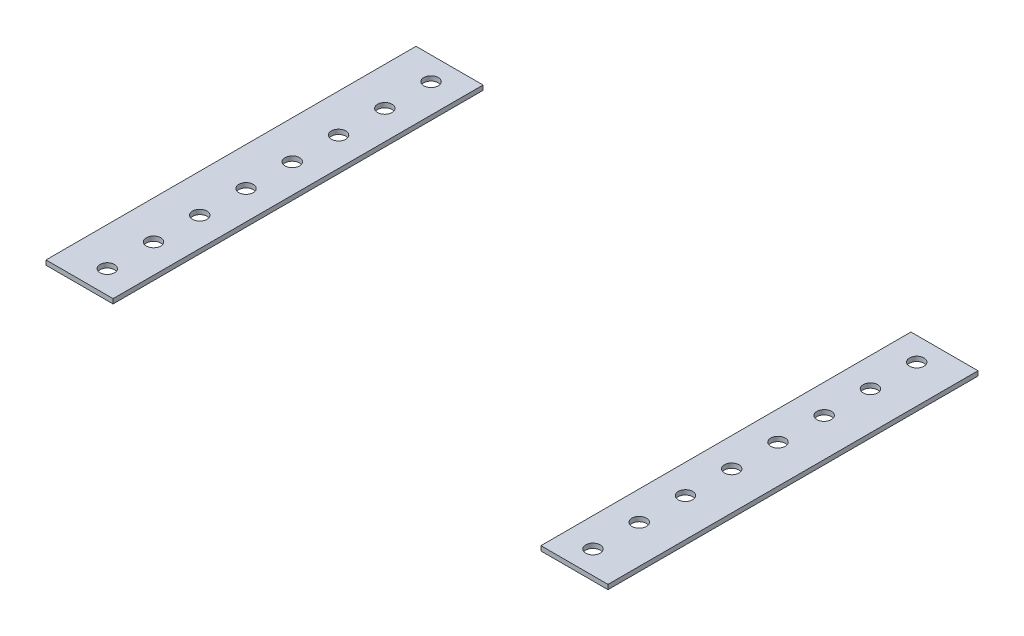
ISO-10303-21;
HEADER;
FILE_DESCRIPTION(('STEP AP214'),'2;1');
FILE_NAME('part.step','',(''),(''),'','','');
FILE_SCHEMA(('AUTOMOTIVE_DESIGN { 1 0 10303 214 1 1 1 1 }'));
ENDSEC;
DATA;
#1=APPLICATION_CONTEXT('core data for automotive mechanical design processes');
#2=APPLICATION_PROTOCOL_DEFINITION('international standard','automotive_design',2000,#1);
#3=PRODUCT_CONTEXT('',#1,'mechanical');
#4=PRODUCT('Part','Part','',(#3));
#5=PRODUCT_RELATED_PRODUCT_CATEGORY('part','',(#4));
#6=PRODUCT_DEFINITION_FORMATION('','',#4);
#7=PRODUCT_DEFINITION_CONTEXT('part definition',#1,'design');
#8=PRODUCT_DEFINITION('design','',#6,#7);
#9=PRODUCT_DEFINITION_SHAPE('','',#8);
#10=(LENGTH_UNIT() NAMED_UNIT(*) SI_UNIT(.MILLI.,.METRE.));
#11=(NAMED_UNIT(*) PLANE_ANGLE_UNIT() SI_UNIT($,.RADIAN.));
#12=(NAMED_UNIT(*) SI_UNIT($,.STERADIAN.) SOLID_ANGLE_UNIT());
#13=UNCERTAINTY_MEASURE_WITH_UNIT(LENGTH_MEASURE(1.E-05),#10,'distance_accuracy_value','');
#14=(GEOMETRIC_REPRESENTATION_CONTEXT(3) GLOBAL_UNCERTAINTY_ASSIGNED_CONTEXT((#13)) GLOBAL_UNIT_ASSIGNED_CONTEXT((#10,
#11,#12)) REPRESENTATION_CONTEXT('',''));
#15=CARTESIAN_POINT('',(0.,0.,0.));
#16=DIRECTION('',(0.,0.,1.));
#17=DIRECTION('',(1.,0.,0.));
#18=AXIS2_PLACEMENT_3D('',#15,#16,#17);
#19=CARTESIAN_POINT('',(170.474891640867,-2.54,-175.499845201238));
#20=DIRECTION('',(1.,0.,0.));
#21=DIRECTION('',(0.,0.,-1.));
#22=AXIS2_PLACEMENT_3D('',#19,#20,#21);
#23=PLANE('',#22);
#24=DIRECTION('',(0.,0.,-1.));
#25=VECTOR('',#24,1.);
#26=CARTESIAN_POINT('',(170.474891640867,0.,-175.499845201238));
#27=LINE('',#26,#25);
#28=CARTESIAN_POINT('',(170.474891640867,0.,27.7001547987616));
#29=VERTEX_POINT('',#28);
#30=CARTESIAN_POINT('',(170.474891640867,0.,-175.499845201238));
#31=VERTEX_POINT('',#30);
#32=EDGE_CURVE('E108',#29,#31,#27,.T.);
#33=ORIENTED_EDGE('',*,*,#32,.F.);
#34=DIRECTION('',(0.,1.,0.));
#35=VECTOR('',#34,1.);
#36=CARTESIAN_POINT('',(170.474891640867,-2.54,27.7001547987616));
#37=LINE('',#36,#35);
#38=CARTESIAN_POINT('',(170.474891640867,-2.54,27.7001547987616));
#39=VERTEX_POINT('',#38);
#40=EDGE_CURVE('E12',#39,#29,#37,.T.);
#41=ORIENTED_EDGE('',*,*,#40,.F.);
#42=DIRECTION('',(0.,0.,-1.));
#43=VECTOR('',#42,1.);
#44=CARTESIAN_POINT('',(170.474891640867,-2.54,-175.499845201238));
#45=LINE('',#44,#43);
#46=CARTESIAN_POINT('',(170.474891640867,-2.54,-175.499845201238));
#47=VERTEX_POINT('',#46);
#48=EDGE_CURVE('E101',#39,#47,#45,.T.);
#49=ORIENTED_EDGE('',*,*,#48,.T.);
#50=DIRECTION('',(0.,1.,0.));
#51=VECTOR('',#50,1.);
#52=CARTESIAN_POINT('',(170.474891640867,-2.54,-175.499845201238));
#53=LINE('',#52,#51);
#54=EDGE_CURVE('E46',#47,#31,#53,.T.);
#55=ORIENTED_EDGE('',*,*,#54,.T.);
#56=EDGE_LOOP('',(#33,#41,#49,#55));
#57=FACE_BOUND('',#56,.T.);
#58=ADVANCED_FACE('F43',(#57),#23,.T.);
#59=CARTESIAN_POINT('',(170.474891640867,-2.54,27.7001547987616));
#60=DIRECTION('',(0.,0.,1.));
#61=DIRECTION('',(1.,0.,0.));
#62=AXIS2_PLACEMENT_3D('',#59,#60,#61);
#63=PLANE('',#62);
#64=DIRECTION('',(1.,0.,0.));
#65=VECTOR('',#64,1.);
#66=CARTESIAN_POINT('',(170.474891640867,0.,27.7001547987616));
#67=LINE('',#66,#65);
#68=CARTESIAN_POINT('',(133.644891640867,0.,27.7001547987616));
#69=VERTEX_POINT('',#68);
#70=EDGE_CURVE('E103',#69,#29,#67,.T.);
#71=ORIENTED_EDGE('',*,*,#70,.F.);
#72=DIRECTION('',(0.,1.,0.));
#73=VECTOR('',#72,1.);
#74=CARTESIAN_POINT('',(133.644891640867,-2.54,27.7001547987616));
#75=LINE('',#74,#73);
#76=CARTESIAN_POINT('',(133.644891640867,-2.54,27.7001547987616));
#77=VERTEX_POINT('',#76);
#78=EDGE_CURVE('E52',#77,#69,#75,.T.);
#79=ORIENTED_EDGE('',*,*,#78,.F.);
#80=DIRECTION('',(1.,0.,0.));
#81=VECTOR('',#80,1.);
#82=CARTESIAN_POINT('',(170.474891640867,-2.54,27.7001547987616));
#83=LINE('',#82,#81);
#84=EDGE_CURVE('E98',#77,#39,#83,.T.);
#85=ORIENTED_EDGE('',*,*,#84,.T.);
#86=ORIENTED_EDGE('',*,*,#40,.T.);
#87=EDGE_LOOP('',(#71,#79,#85,#86));
#88=FACE_BOUND('',#87,.T.);
#89=ADVANCED_FACE('F119',(#88),#63,.T.);
#90=CARTESIAN_POINT('',(133.644891640867,-2.54,-175.499845201238));
#91=DIRECTION('',(-1.,0.,0.));
#92=DIRECTION('',(0.,0.,1.));
#93=AXIS2_PLACEMENT_3D('',#90,#91,#92);
#94=PLANE('',#93);
#95=DIRECTION('',(0.,0.,1.));
#96=VECTOR('',#95,1.);
#97=CARTESIAN_POINT('',(133.644891640867,0.,-175.499845201238));
#98=LINE('',#97,#96);
#99=CARTESIAN_POINT('',(133.644891640867,0.,-175.499845201238));
#100=VERTEX_POINT('',#99);
#101=EDGE_CURVE('E93',#100,#69,#98,.T.);
#102=ORIENTED_EDGE('',*,*,#101,.F.);
#103=DIRECTION('',(0.,1.,0.));
#104=VECTOR('',#103,1.);
#105=CARTESIAN_POINT('',(133.644891640867,-2.54,-175.499845201238));
#106=LINE('',#105,#104);
#107=CARTESIAN_POINT('',(133.644891640867,-2.54,-175.499845201238));
#108=VERTEX_POINT('',#107);
#109=EDGE_CURVE('E88',#108,#100,#106,.T.);
#110=ORIENTED_EDGE('',*,*,#109,.F.);
#111=DIRECTION('',(0.,0.,1.));
#112=VECTOR('',#111,1.);
#113=CARTESIAN_POINT('',(133.644891640867,-2.54,-175.499845201238));
#114=LINE('',#113,#112);
#115=EDGE_CURVE('E91',#108,#77,#114,.T.);
#116=ORIENTED_EDGE('',*,*,#115,.T.);
#117=ORIENTED_EDGE('',*,*,#78,.T.);
#118=EDGE_LOOP('',(#102,#110,#116,#117));
#119=FACE_BOUND('',#118,.T.);
#120=ADVANCED_FACE('F90',(#119),#94,.T.);
#121=CARTESIAN_POINT('',(170.474891640867,-2.54,-175.499845201238));
#122=DIRECTION('',(0.,0.,-1.));
#123=DIRECTION('',(-1.,0.,0.));
#124=AXIS2_PLACEMENT_3D('',#121,#122,#123);
#125=PLANE('',#124);
#126=DIRECTION('',(-1.,0.,0.));
#127=VECTOR('',#126,1.);
#128=CARTESIAN_POINT('',(170.474891640867,0.,-175.499845201238));
#129=LINE('',#128,#127);
#130=EDGE_CURVE('E111',#31,#100,#129,.T.);
#131=ORIENTED_EDGE('',*,*,#130,.F.);
#132=ORIENTED_EDGE('',*,*,#54,.F.);
#133=DIRECTION('',(-1.,0.,0.));
#134=VECTOR('',#133,1.);
#135=CARTESIAN_POINT('',(170.474891640867,-2.54,-175.499845201238));
#136=LINE('',#135,#134);
#137=EDGE_CURVE('E97',#47,#108,#136,.T.);
#138=ORIENTED_EDGE('',*,*,#137,.T.);
#139=ORIENTED_EDGE('',*,*,#109,.T.);
#140=EDGE_LOOP('',(#131,#132,#138,#139));
#141=FACE_BOUND('',#140,.T.);
#142=ADVANCED_FACE('F100',(#141),#125,.T.);
#143=CARTESIAN_POINT('',(0.,-2.54,0.));
#144=DIRECTION('',(0.,-1.,0.));
#145=DIRECTION('',(0.,0.,-1.));
#146=AXIS2_PLACEMENT_3D('',#143,#144,#145);
#147=PLANE('',#146);
#148=CARTESIAN_POINT('',(149.519891640867,-2.54,15.0001547987616));
#149=DIRECTION('',(0.,-1.,0.));
#150=DIRECTION('',(0.,0.,-1.));
#151=AXIS2_PLACEMENT_3D('',#148,#149,#150);
#152=CIRCLE('',#151,3.96874999999999);
#153=CARTESIAN_POINT('',(149.519891640867,-2.54,11.0314047987616));
#154=VERTEX_POINT('',#153);
#155=EDGE_CURVE('E176',#154,#154,#152,.F.);
#156=ORIENTED_EDGE('',*,*,#155,.T.);
#157=EDGE_LOOP('',(#156));
#158=FACE_BOUND('',#157,.T.);
#159=CARTESIAN_POINT('',(149.519891640867,-2.54,-10.3998452012384));
#160=DIRECTION('',(0.,-1.,0.));
#161=DIRECTION('',(0.,0.,-1.));
#162=AXIS2_PLACEMENT_3D('',#159,#160,#161);
#163=CIRCLE('',#162,3.96874999999999);
#164=CARTESIAN_POINT('',(149.519891640867,-2.54,-14.3685952012384));
#165=VERTEX_POINT('',#164);
#166=EDGE_CURVE('E185',#165,#165,#163,.F.);
#167=ORIENTED_EDGE('',*,*,#166,.T.);
#168=EDGE_LOOP('',(#167));
#169=FACE_BOUND('',#168,.T.);
#170=CARTESIAN_POINT('',(149.519891640867,-2.54,-35.7998452012384));
#171=DIRECTION('',(0.,-1.,0.));
#172=DIRECTION('',(0.,0.,-1.));
#173=AXIS2_PLACEMENT_3D('',#170,#171,#172);
#174=CIRCLE('',#173,3.96875000000002);
#175=CARTESIAN_POINT('',(149.519891640867,-2.54,-39.7685952012384));
#176=VERTEX_POINT('',#175);
#177=EDGE_CURVE('E191',#176,#176,#174,.F.);
#178=ORIENTED_EDGE('',*,*,#177,.T.);
#179=EDGE_LOOP('',(#178));
#180=FACE_BOUND('',#179,.T.);
#181=CARTESIAN_POINT('',(149.519891640867,-2.54,-61.1998452012384));
#182=DIRECTION('',(0.,-1.,0.));
#183=DIRECTION('',(0.,0.,-1.));
#184=AXIS2_PLACEMENT_3D('',#181,#182,#183);
#185=CIRCLE('',#184,3.96875000000002);
#186=CARTESIAN_POINT('',(149.519891640867,-2.54,-65.1685952012384));
#187=VERTEX_POINT('',#186);
#188=EDGE_CURVE('E197',#187,#187,#185,.F.);
#189=ORIENTED_EDGE('',*,*,#188,.T.);
#190=EDGE_LOOP('',(#189));
#191=FACE_BOUND('',#190,.T.);
#192=CARTESIAN_POINT('',(149.519891640867,-2.54,-86.5998452012384));
#193=DIRECTION('',(0.,-1.,0.));
#194=DIRECTION('',(0.,0.,-1.));
#195=AXIS2_PLACEMENT_3D('',#192,#193,#194);
#196=CIRCLE('',#195,3.96875000000002);
#197=CARTESIAN_POINT('',(149.519891640867,-2.54,-90.5685952012384));
#198=VERTEX_POINT('',#197);
#199=EDGE_CURVE('E203',#198,#198,#196,.F.);
#200=ORIENTED_EDGE('',*,*,#199,.T.);
#201=EDGE_LOOP('',(#200));
#202=FACE_BOUND('',#201,.T.);
#203=CARTESIAN_POINT('',(149.519891640867,-2.54,-111.999845201238));
#204=DIRECTION('',(0.,-1.,0.));
#205=DIRECTION('',(0.,0.,-1.));
#206=AXIS2_PLACEMENT_3D('',#203,#204,#205);
#207=CIRCLE('',#206,3.96874999999999);
#208=CARTESIAN_POINT('',(149.519891640867,-2.54,-115.968595201238));
#209=VERTEX_POINT('',#208);
#210=EDGE_CURVE('E209',#209,#209,#207,.F.);
#211=ORIENTED_EDGE('',*,*,#210,.T.);
#212=EDGE_LOOP('',(#211));
#213=FACE_BOUND('',#212,.T.);
#214=CARTESIAN_POINT('',(149.519891640867,-2.54,-137.399845201238));
#215=DIRECTION('',(0.,-1.,0.));
#216=DIRECTION('',(0.,0.,-1.));
#217=AXIS2_PLACEMENT_3D('',#214,#215,#216);
#218=CIRCLE('',#217,3.96874999999999);
#219=CARTESIAN_POINT('',(149.519891640867,-2.54,-141.368595201238));
#220=VERTEX_POINT('',#219);
#221=EDGE_CURVE('E215',#220,#220,#218,.F.);
#222=ORIENTED_EDGE('',*,*,#221,.T.);
#223=EDGE_LOOP('',(#222));
#224=FACE_BOUND('',#223,.T.);
#225=CARTESIAN_POINT('',(149.519891640867,-2.54,-162.799845201238));
#226=DIRECTION('',(0.,-1.,0.));
#227=DIRECTION('',(0.,0.,-1.));
#228=AXIS2_PLACEMENT_3D('',#225,#226,#227);
#229=CIRCLE('',#228,3.96874999999999);
#230=CARTESIAN_POINT('',(149.519891640867,-2.54,-166.768595201238));
#231=VERTEX_POINT('',#230);
#232=EDGE_CURVE('E220',#231,#231,#229,.F.);
#233=ORIENTED_EDGE('',*,*,#232,.T.);
#234=EDGE_LOOP('',(#233));
#235=FACE_BOUND('',#234,.T.);
#236=ORIENTED_EDGE('',*,*,#48,.F.);
#237=ORIENTED_EDGE('',*,*,#84,.F.);
#238=ORIENTED_EDGE('',*,*,#115,.F.);
#239=ORIENTED_EDGE('',*,*,#137,.F.);
#240=EDGE_LOOP('',(#236,#237,#238,#239));
#241=FACE_BOUND('',#240,.T.);
#242=ADVANCED_FACE('F96',(#158,#169,#180,#191,#202,#213,#224,#235,#241),#147,.T.);
#243=CARTESIAN_POINT('',(0.,0.,0.));
#244=DIRECTION('',(0.,-1.,0.));
#245=DIRECTION('',(0.,0.,-1.));
#246=AXIS2_PLACEMENT_3D('',#243,#244,#245);
#247=PLANE('',#246);
#248=CARTESIAN_POINT('',(149.519891640867,0.,15.0001547987616));
#249=DIRECTION('',(0.,1.,0.));
#250=DIRECTION('',(0.,0.,-1.));
#251=AXIS2_PLACEMENT_3D('',#248,#249,#250);
#252=CIRCLE('',#251,3.96874999999999);
#253=CARTESIAN_POINT('',(149.519891640867,0.,11.0314047987616));
#254=VERTEX_POINT('',#253);
#255=EDGE_CURVE('E112',#254,#254,#252,.T.);
#256=ORIENTED_EDGE('',*,*,#255,.F.);
#257=EDGE_LOOP('',(#256));
#258=FACE_BOUND('',#257,.T.);
#259=CARTESIAN_POINT('',(149.519891640867,0.,-10.3998452012384));
#260=DIRECTION('',(0.,1.,0.));
#261=DIRECTION('',(0.,0.,-1.));
#262=AXIS2_PLACEMENT_3D('',#259,#260,#261);
#263=CIRCLE('',#262,3.96874999999999);
#264=CARTESIAN_POINT('',(149.519891640867,0.,-14.3685952012384));
#265=VERTEX_POINT('',#264);
#266=EDGE_CURVE('E180',#265,#265,#263,.T.);
#267=ORIENTED_EDGE('',*,*,#266,.F.);
#268=EDGE_LOOP('',(#267));
#269=FACE_BOUND('',#268,.T.);
#270=CARTESIAN_POINT('',(149.519891640867,0.,-35.7998452012384));
#271=DIRECTION('',(0.,1.,0.));
#272=DIRECTION('',(0.,0.,-1.));
#273=AXIS2_PLACEMENT_3D('',#270,#271,#272);
#274=CIRCLE('',#273,3.96875000000002);
#275=CARTESIAN_POINT('',(149.519891640867,0.,-39.7685952012384));
#276=VERTEX_POINT('',#275);
#277=EDGE_CURVE('E188',#276,#276,#274,.T.);
#278=ORIENTED_EDGE('',*,*,#277,.F.);
#279=EDGE_LOOP('',(#278));
#280=FACE_BOUND('',#279,.T.);
#281=CARTESIAN_POINT('',(149.519891640867,0.,-61.1998452012384));
#282=DIRECTION('',(0.,1.,0.));
#283=DIRECTION('',(0.,0.,-1.));
#284=AXIS2_PLACEMENT_3D('',#281,#282,#283);
#285=CIRCLE('',#284,3.96875000000002);
#286=CARTESIAN_POINT('',(149.519891640867,0.,-65.1685952012384));
#287=VERTEX_POINT('',#286);
#288=EDGE_CURVE('E194',#287,#287,#285,.T.);
#289=ORIENTED_EDGE('',*,*,#288,.F.);
#290=EDGE_LOOP('',(#289));
#291=FACE_BOUND('',#290,.T.);
#292=CARTESIAN_POINT('',(149.519891640867,0.,-86.5998452012384));
#293=DIRECTION('',(0.,1.,0.));
#294=DIRECTION('',(0.,0.,-1.));
#295=AXIS2_PLACEMENT_3D('',#292,#293,#294);
#296=CIRCLE('',#295,3.96875000000002);
#297=CARTESIAN_POINT('',(149.519891640867,0.,-90.5685952012384));
#298=VERTEX_POINT('',#297);
#299=EDGE_CURVE('E200',#298,#298,#296,.T.);
#300=ORIENTED_EDGE('',*,*,#299,.F.);
#301=EDGE_LOOP('',(#300));
#302=FACE_BOUND('',#301,.T.);
#303=CARTESIAN_POINT('',(149.519891640867,0.,-111.999845201238));
#304=DIRECTION('',(0.,1.,0.));
#305=DIRECTION('',(0.,0.,-1.));
#306=AXIS2_PLACEMENT_3D('',#303,#304,#305);
#307=CIRCLE('',#306,3.96874999999999);
#308=CARTESIAN_POINT('',(149.519891640867,0.,-115.968595201238));
#309=VERTEX_POINT('',#308);
#310=EDGE_CURVE('E206',#309,#309,#307,.T.);
#311=ORIENTED_EDGE('',*,*,#310,.F.);
#312=EDGE_LOOP('',(#311));
#313=FACE_BOUND('',#312,.T.);
#314=CARTESIAN_POINT('',(149.519891640867,0.,-137.399845201238));
#315=DIRECTION('',(0.,1.,0.));
#316=DIRECTION('',(0.,0.,-1.));
#317=AXIS2_PLACEMENT_3D('',#314,#315,#316);
#318=CIRCLE('',#317,3.96874999999999);
#319=CARTESIAN_POINT('',(149.519891640867,0.,-141.368595201238));
#320=VERTEX_POINT('',#319);
#321=EDGE_CURVE('E212',#320,#320,#318,.T.);
#322=ORIENTED_EDGE('',*,*,#321,.F.);
#323=EDGE_LOOP('',(#322));
#324=FACE_BOUND('',#323,.T.);
#325=CARTESIAN_POINT('',(149.519891640867,0.,-162.799845201238));
#326=DIRECTION('',(0.,1.,0.));
#327=DIRECTION('',(0.,0.,-1.));
#328=AXIS2_PLACEMENT_3D('',#325,#326,#327);
#329=CIRCLE('',#328,3.96874999999999);
#330=CARTESIAN_POINT('',(149.519891640867,0.,-166.768595201238));
#331=VERTEX_POINT('',#330);
#332=EDGE_CURVE('E218',#331,#331,#329,.T.);
#333=ORIENTED_EDGE('',*,*,#332,.F.);
#334=EDGE_LOOP('',(#333));
#335=FACE_BOUND('',#334,.T.);
#336=ORIENTED_EDGE('',*,*,#32,.T.);
#337=ORIENTED_EDGE('',*,*,#130,.T.);
#338=ORIENTED_EDGE('',*,*,#101,.T.);
#339=ORIENTED_EDGE('',*,*,#70,.T.);
#340=EDGE_LOOP('',(#336,#337,#338,#339));
#341=FACE_BOUND('',#340,.T.);
#342=ADVANCED_FACE('F118',(#258,#269,#280,#291,#302,#313,#324,#335,#341),#247,.F.);
#343=CARTESIAN_POINT('',(149.519891640867,-2.541,-162.799845201238));
#344=DIRECTION('',(0.,1.,0.));
#345=DIRECTION('',(0.,0.,1.));
#346=AXIS2_PLACEMENT_3D('',#343,#344,#345);
#347=CYLINDRICAL_SURFACE('',#346,3.96874999999999);
#348=ORIENTED_EDGE('',*,*,#232,.F.);
#349=EDGE_LOOP('',(#348));
#350=FACE_BOUND('',#349,.T.);
#351=ORIENTED_EDGE('',*,*,#332,.T.);
#352=EDGE_LOOP('',(#351));
#353=FACE_BOUND('',#352,.T.);
#354=ADVANCED_FACE('F137',(#350,#353),#347,.F.);
#355=CARTESIAN_POINT('',(149.519891640867,-2.541,-137.399845201238));
#356=DIRECTION('',(0.,1.,0.));
#357=DIRECTION('',(0.,0.,1.));
#358=AXIS2_PLACEMENT_3D('',#355,#356,#357);
#359=CYLINDRICAL_SURFACE('',#358,3.96874999999999);
#360=ORIENTED_EDGE('',*,*,#221,.F.);
#361=EDGE_LOOP('',(#360));
#362=FACE_BOUND('',#361,.T.);
#363=ORIENTED_EDGE('',*,*,#321,.T.);
#364=EDGE_LOOP('',(#363));
#365=FACE_BOUND('',#364,.T.);
#366=ADVANCED_FACE('F144',(#362,#365),#359,.F.);
#367=CARTESIAN_POINT('',(149.519891640867,-2.541,-111.999845201238));
#368=DIRECTION('',(0.,1.,0.));
#369=DIRECTION('',(0.,0.,1.));
#370=AXIS2_PLACEMENT_3D('',#367,#368,#369);
#371=CYLINDRICAL_SURFACE('',#370,3.96874999999999);
#372=ORIENTED_EDGE('',*,*,#210,.F.);
#373=EDGE_LOOP('',(#372));
#374=FACE_BOUND('',#373,.T.);
#375=ORIENTED_EDGE('',*,*,#310,.T.);
#376=EDGE_LOOP('',(#375));
#377=FACE_BOUND('',#376,.T.);
#378=ADVANCED_FACE('F148',(#374,#377),#371,.F.);
#379=CARTESIAN_POINT('',(149.519891640867,-2.541,-86.5998452012384));
#380=DIRECTION('',(0.,1.,0.));
#381=DIRECTION('',(0.,0.,1.));
#382=AXIS2_PLACEMENT_3D('',#379,#380,#381);
#383=CYLINDRICAL_SURFACE('',#382,3.96875000000002);
#384=ORIENTED_EDGE('',*,*,#199,.F.);
#385=EDGE_LOOP('',(#384));
#386=FACE_BOUND('',#385,.T.);
#387=ORIENTED_EDGE('',*,*,#299,.T.);
#388=EDGE_LOOP('',(#387));
#389=FACE_BOUND('',#388,.T.);
#390=ADVANCED_FACE('F152',(#386,#389),#383,.F.);
#391=CARTESIAN_POINT('',(149.519891640867,-2.541,-61.1998452012384));
#392=DIRECTION('',(0.,1.,0.));
#393=DIRECTION('',(0.,0.,1.));
#394=AXIS2_PLACEMENT_3D('',#391,#392,#393);
#395=CYLINDRICAL_SURFACE('',#394,3.96875000000002);
#396=ORIENTED_EDGE('',*,*,#188,.F.);
#397=EDGE_LOOP('',(#396));
#398=FACE_BOUND('',#397,.T.);
#399=ORIENTED_EDGE('',*,*,#288,.T.);
#400=EDGE_LOOP('',(#399));
#401=FACE_BOUND('',#400,.T.);
#402=ADVANCED_FACE('F156',(#398,#401),#395,.F.);
#403=CARTESIAN_POINT('',(149.519891640867,-2.541,-35.7998452012384));
#404=DIRECTION('',(0.,1.,0.));
#405=DIRECTION('',(0.,0.,1.));
#406=AXIS2_PLACEMENT_3D('',#403,#404,#405);
#407=CYLINDRICAL_SURFACE('',#406,3.96875000000002);
#408=ORIENTED_EDGE('',*,*,#177,.F.);
#409=EDGE_LOOP('',(#408));
#410=FACE_BOUND('',#409,.T.);
#411=ORIENTED_EDGE('',*,*,#277,.T.);
#412=EDGE_LOOP('',(#411));
#413=FACE_BOUND('',#412,.T.);
#414=ADVANCED_FACE('F160',(#410,#413),#407,.F.);
#415=CARTESIAN_POINT('',(149.519891640867,-2.541,-10.3998452012384));
#416=DIRECTION('',(0.,1.,0.));
#417=DIRECTION('',(0.,0.,1.));
#418=AXIS2_PLACEMENT_3D('',#415,#416,#417);
#419=CYLINDRICAL_SURFACE('',#418,3.96874999999999);
#420=ORIENTED_EDGE('',*,*,#166,.F.);
#421=EDGE_LOOP('',(#420));
#422=FACE_BOUND('',#421,.T.);
#423=ORIENTED_EDGE('',*,*,#266,.T.);
#424=EDGE_LOOP('',(#423));
#425=FACE_BOUND('',#424,.T.);
#426=ADVANCED_FACE('F164',(#422,#425),#419,.F.);
#427=CARTESIAN_POINT('',(149.519891640867,-2.541,15.0001547987616));
#428=DIRECTION('',(0.,1.,0.));
#429=DIRECTION('',(0.,0.,1.));
#430=AXIS2_PLACEMENT_3D('',#427,#428,#429);
#431=CYLINDRICAL_SURFACE('',#430,3.96874999999999);
#432=ORIENTED_EDGE('',*,*,#155,.F.);
#433=EDGE_LOOP('',(#432));
#434=FACE_BOUND('',#433,.T.);
#435=ORIENTED_EDGE('',*,*,#255,.T.);
#436=EDGE_LOOP('',(#435));
#437=FACE_BOUND('',#436,.T.);
#438=ADVANCED_FACE('F168',(#434,#437),#431,.F.);
#439=CLOSED_SHELL('',(#58,#89,#120,#142,#242,#342,#354,#366,#378,#390,#402,#414,#426,#438));
#440=MANIFOLD_SOLID_BREP('B2',#439);
#441=CARTESIAN_POINT('',(-138.135108359133,-2.54,-175.499845201238));
#442=DIRECTION('',(-1.,0.,0.));
#443=DIRECTION('',(0.,0.,1.));
#444=AXIS2_PLACEMENT_3D('',#441,#442,#443);
#445=PLANE('',#444);
#446=DIRECTION('',(0.,0.,1.));
#447=VECTOR('',#446,1.);
#448=CARTESIAN_POINT('',(-138.135108359133,0.,-175.499845201238));
#449=LINE('',#448,#447);
#450=CARTESIAN_POINT('',(-138.135108359133,0.,-175.499845201238));
#451=VERTEX_POINT('',#450);
#452=CARTESIAN_POINT('',(-138.135108359133,0.,27.7001547987616));
#453=VERTEX_POINT('',#452);
#454=EDGE_CURVE('E400',#451,#453,#449,.T.);
#455=ORIENTED_EDGE('',*,*,#454,.F.);
#456=DIRECTION('',(0.,1.,0.));
#457=VECTOR('',#456,1.);
#458=CARTESIAN_POINT('',(-138.135108359133,-2.54,-175.499845201238));
#459=LINE('',#458,#457);
#460=CARTESIAN_POINT('',(-138.135108359133,-2.54,-175.499845201238));
#461=VERTEX_POINT('',#460);
#462=EDGE_CURVE('E41',#461,#451,#459,.T.);
#463=ORIENTED_EDGE('',*,*,#462,.F.);
#464=DIRECTION('',(0.,0.,1.));
#465=VECTOR('',#464,1.);
#466=CARTESIAN_POINT('',(-138.135108359133,-2.54,-175.499845201238));
#467=LINE('',#466,#465);
#468=CARTESIAN_POINT('',(-138.135108359133,-2.54,27.7001547987616));
#469=VERTEX_POINT('',#468);
#470=EDGE_CURVE('E393',#461,#469,#467,.T.);
#471=ORIENTED_EDGE('',*,*,#470,.T.);
#472=DIRECTION('',(0.,1.,0.));
#473=VECTOR('',#472,1.);
#474=CARTESIAN_POINT('',(-138.135108359133,-2.54,27.7001547987616));
#475=LINE('',#474,#473);
#476=EDGE_CURVE('E338',#469,#453,#475,.T.);
#477=ORIENTED_EDGE('',*,*,#476,.T.);
#478=EDGE_LOOP('',(#455,#463,#471,#477));
#479=FACE_BOUND('',#478,.T.);
#480=ADVANCED_FACE('F335',(#479),#445,.T.);
#481=CARTESIAN_POINT('',(-138.135108359133,-2.54,-175.499845201238));
#482=DIRECTION('',(0.,0.,-1.));
#483=DIRECTION('',(-1.,0.,0.));
#484=AXIS2_PLACEMENT_3D('',#481,#482,#483);
#485=PLANE('',#484);
#486=DIRECTION('',(-1.,0.,0.));
#487=VECTOR('',#486,1.);
#488=CARTESIAN_POINT('',(-138.135108359133,0.,-175.499845201238));
#489=LINE('',#488,#487);
#490=CARTESIAN_POINT('',(-101.305108359133,0.,-175.499845201238));
#491=VERTEX_POINT('',#490);
#492=EDGE_CURVE('E395',#491,#451,#489,.T.);
#493=ORIENTED_EDGE('',*,*,#492,.F.);
#494=DIRECTION('',(0.,1.,0.));
#495=VECTOR('',#494,1.);
#496=CARTESIAN_POINT('',(-101.305108359133,-2.54,-175.499845201238));
#497=LINE('',#496,#495);
#498=CARTESIAN_POINT('',(-101.305108359133,-2.54,-175.499845201238));
#499=VERTEX_POINT('',#498);
#500=EDGE_CURVE('E344',#499,#491,#497,.T.);
#501=ORIENTED_EDGE('',*,*,#500,.F.);
#502=DIRECTION('',(-1.,0.,0.));
#503=VECTOR('',#502,1.);
#504=CARTESIAN_POINT('',(-138.135108359133,-2.54,-175.499845201238));
#505=LINE('',#504,#503);
#506=EDGE_CURVE('E390',#499,#461,#505,.T.);
#507=ORIENTED_EDGE('',*,*,#506,.T.);
#508=ORIENTED_EDGE('',*,*,#462,.T.);
#509=EDGE_LOOP('',(#493,#501,#507,#508));
#510=FACE_BOUND('',#509,.T.);
#511=ADVANCED_FACE('F411',(#510),#485,.T.);
#512=CARTESIAN_POINT('',(-101.305108359133,-2.54,-175.499845201238));
#513=DIRECTION('',(1.,0.,0.));
#514=DIRECTION('',(0.,0.,-1.));
#515=AXIS2_PLACEMENT_3D('',#512,#513,#514);
#516=PLANE('',#515);
#517=DIRECTION('',(0.,0.,-1.));
#518=VECTOR('',#517,1.);
#519=CARTESIAN_POINT('',(-101.305108359133,0.,-175.499845201238));
#520=LINE('',#519,#518);
#521=CARTESIAN_POINT('',(-101.305108359133,0.,27.7001547987616));
#522=VERTEX_POINT('',#521);
#523=EDGE_CURVE('E385',#522,#491,#520,.T.);
#524=ORIENTED_EDGE('',*,*,#523,.F.);
#525=DIRECTION('',(0.,1.,0.));
#526=VECTOR('',#525,1.);
#527=CARTESIAN_POINT('',(-101.305108359133,-2.54,27.7001547987616));
#528=LINE('',#527,#526);
#529=CARTESIAN_POINT('',(-101.305108359133,-2.54,27.7001547987616));
#530=VERTEX_POINT('',#529);
#531=EDGE_CURVE('E380',#530,#522,#528,.T.);
#532=ORIENTED_EDGE('',*,*,#531,.F.);
#533=DIRECTION('',(0.,0.,-1.));
#534=VECTOR('',#533,1.);
#535=CARTESIAN_POINT('',(-101.305108359133,-2.54,-175.499845201238));
#536=LINE('',#535,#534);
#537=EDGE_CURVE('E383',#530,#499,#536,.T.);
#538=ORIENTED_EDGE('',*,*,#537,.T.);
#539=ORIENTED_EDGE('',*,*,#500,.T.);
#540=EDGE_LOOP('',(#524,#532,#538,#539));
#541=FACE_BOUND('',#540,.T.);
#542=ADVANCED_FACE('F382',(#541),#516,.T.);
#543=CARTESIAN_POINT('',(-138.135108359133,-2.54,27.7001547987616));
#544=DIRECTION('',(0.,0.,1.));
#545=DIRECTION('',(1.,0.,0.));
#546=AXIS2_PLACEMENT_3D('',#543,#544,#545);
#547=PLANE('',#546);
#548=DIRECTION('',(1.,0.,0.));
#549=VECTOR('',#548,1.);
#550=CARTESIAN_POINT('',(-138.135108359133,0.,27.7001547987616));
#551=LINE('',#550,#549);
#552=EDGE_CURVE('E403',#453,#522,#551,.T.);
#553=ORIENTED_EDGE('',*,*,#552,.F.);
#554=ORIENTED_EDGE('',*,*,#476,.F.);
#555=DIRECTION('',(1.,0.,0.));
#556=VECTOR('',#555,1.);
#557=CARTESIAN_POINT('',(-138.135108359133,-2.54,27.7001547987616));
#558=LINE('',#557,#556);
#559=EDGE_CURVE('E389',#469,#530,#558,.T.);
#560=ORIENTED_EDGE('',*,*,#559,.T.);
#561=ORIENTED_EDGE('',*,*,#531,.T.);
#562=EDGE_LOOP('',(#553,#554,#560,#561));
#563=FACE_BOUND('',#562,.T.);
#564=ADVANCED_FACE('F392',(#563),#547,.T.);
#565=CARTESIAN_POINT('',(0.,-2.54,0.));
#566=DIRECTION('',(0.,1.,0.));
#567=DIRECTION('',(0.,0.,1.));
#568=AXIS2_PLACEMENT_3D('',#565,#566,#567);
#569=PLANE('',#568);
#570=CARTESIAN_POINT('',(-117.180108359133,-2.54,-162.799845201238));
#571=DIRECTION('',(0.,1.,0.));
#572=DIRECTION('',(0.,0.,1.));
#573=AXIS2_PLACEMENT_3D('',#570,#571,#572);
#574=CIRCLE('',#573,3.96874999999999);
#575=CARTESIAN_POINT('',(-117.180108359133,-2.54,-158.831095201238));
#576=VERTEX_POINT('',#575);
#577=EDGE_CURVE('E404',#576,#576,#574,.F.);
#578=ORIENTED_EDGE('',*,*,#577,.F.);
#579=EDGE_LOOP('',(#578));
#580=FACE_BOUND('',#579,.T.);
#581=CARTESIAN_POINT('',(-117.180108359133,-2.54,-137.399845201238));
#582=DIRECTION('',(0.,1.,0.));
#583=DIRECTION('',(0.,0.,1.));
#584=AXIS2_PLACEMENT_3D('',#581,#582,#583);
#585=CIRCLE('',#584,3.96874999999999);
#586=CARTESIAN_POINT('',(-117.180108359133,-2.54,-133.431095201238));
#587=VERTEX_POINT('',#586);
#588=EDGE_CURVE('E472',#587,#587,#585,.F.);
#589=ORIENTED_EDGE('',*,*,#588,.F.);
#590=EDGE_LOOP('',(#589));
#591=FACE_BOUND('',#590,.T.);
#592=CARTESIAN_POINT('',(-117.180108359133,-2.54,-111.999845201238));
#593=DIRECTION('',(0.,1.,0.));
#594=DIRECTION('',(0.,0.,1.));
#595=AXIS2_PLACEMENT_3D('',#592,#593,#594);
#596=CIRCLE('',#595,3.96874999999999);
#597=CARTESIAN_POINT('',(-117.180108359133,-2.54,-108.031095201238));
#598=VERTEX_POINT('',#597);
#599=EDGE_CURVE('E478',#598,#598,#596,.F.);
#600=ORIENTED_EDGE('',*,*,#599,.F.);
#601=EDGE_LOOP('',(#600));
#602=FACE_BOUND('',#601,.T.);
#603=CARTESIAN_POINT('',(-117.180108359133,-2.54,-86.5998452012384));
#604=DIRECTION('',(0.,1.,0.));
#605=DIRECTION('',(0.,0.,1.));
#606=AXIS2_PLACEMENT_3D('',#603,#604,#605);
#607=CIRCLE('',#606,3.96875);
#608=CARTESIAN_POINT('',(-117.180108359133,-2.54,-82.6310952012384));
#609=VERTEX_POINT('',#608);
#610=EDGE_CURVE('E484',#609,#609,#607,.F.);
#611=ORIENTED_EDGE('',*,*,#610,.F.);
#612=EDGE_LOOP('',(#611));
#613=FACE_BOUND('',#612,.T.);
#614=CARTESIAN_POINT('',(-117.180108359133,-2.54,-61.1998452012384));
#615=DIRECTION('',(0.,1.,0.));
#616=DIRECTION('',(0.,0.,1.));
#617=AXIS2_PLACEMENT_3D('',#614,#615,#616);
#618=CIRCLE('',#617,3.96875000000001);
#619=CARTESIAN_POINT('',(-117.180108359133,-2.54,-57.2310952012384));
#620=VERTEX_POINT('',#619);
#621=EDGE_CURVE('E490',#620,#620,#618,.F.);
#622=ORIENTED_EDGE('',*,*,#621,.F.);
#623=EDGE_LOOP('',(#622));
#624=FACE_BOUND('',#623,.T.);
#625=CARTESIAN_POINT('',(-117.180108359133,-2.54,-35.7998452012384));
#626=DIRECTION('',(0.,1.,0.));
#627=DIRECTION('',(0.,0.,1.));
#628=AXIS2_PLACEMENT_3D('',#625,#626,#627);
#629=CIRCLE('',#628,3.96875000000001);
#630=CARTESIAN_POINT('',(-117.180108359133,-2.54,-31.8310952012384));
#631=VERTEX_POINT('',#630);
#632=EDGE_CURVE('E496',#631,#631,#629,.F.);
#633=ORIENTED_EDGE('',*,*,#632,.F.);
#634=EDGE_LOOP('',(#633));
#635=FACE_BOUND('',#634,.T.);
#636=CARTESIAN_POINT('',(-117.180108359133,-2.54,-10.3998452012384));
#637=DIRECTION('',(0.,1.,0.));
#638=DIRECTION('',(0.,0.,1.));
#639=AXIS2_PLACEMENT_3D('',#636,#637,#638);
#640=CIRCLE('',#639,3.96874999999999);
#641=CARTESIAN_POINT('',(-117.180108359133,-2.54,-6.43109520123841));
#642=VERTEX_POINT('',#641);
#643=EDGE_CURVE('E502',#642,#642,#640,.F.);
#644=ORIENTED_EDGE('',*,*,#643,.F.);
#645=EDGE_LOOP('',(#644));
#646=FACE_BOUND('',#645,.T.);
#647=CARTESIAN_POINT('',(-117.180108359133,-2.54,15.0001547987616));
#648=DIRECTION('',(0.,1.,0.));
#649=DIRECTION('',(0.,0.,1.));
#650=AXIS2_PLACEMENT_3D('',#647,#648,#649);
#651=CIRCLE('',#650,3.96874999999999);
#652=CARTESIAN_POINT('',(-117.180108359133,-2.54,18.9689047987616));
#653=VERTEX_POINT('',#652);
#654=EDGE_CURVE('E508',#653,#653,#651,.F.);
#655=ORIENTED_EDGE('',*,*,#654,.F.);
#656=EDGE_LOOP('',(#655));
#657=FACE_BOUND('',#656,.T.);
#658=ORIENTED_EDGE('',*,*,#470,.F.);
#659=ORIENTED_EDGE('',*,*,#506,.F.);
#660=ORIENTED_EDGE('',*,*,#537,.F.);
#661=ORIENTED_EDGE('',*,*,#559,.F.);
#662=EDGE_LOOP('',(#658,#659,#660,#661));
#663=FACE_BOUND('',#662,.T.);
#664=ADVANCED_FACE('F388',(#580,#591,#602,#613,#624,#635,#646,#657,#663),#569,.F.);
#665=CARTESIAN_POINT('',(0.,0.,0.));
#666=DIRECTION('',(0.,1.,0.));
#667=DIRECTION('',(0.,0.,1.));
#668=AXIS2_PLACEMENT_3D('',#665,#666,#667);
#669=PLANE('',#668);
#670=CARTESIAN_POINT('',(-117.180108359133,0.,-162.799845201238));
#671=DIRECTION('',(0.,1.,0.));
#672=DIRECTION('',(0.,0.,1.));
#673=AXIS2_PLACEMENT_3D('',#670,#671,#672);
#674=CIRCLE('',#673,3.96874999999999);
#675=CARTESIAN_POINT('',(-117.180108359133,0.,-158.831095201238));
#676=VERTEX_POINT('',#675);
#677=EDGE_CURVE('E469',#676,#676,#674,.T.);
#678=ORIENTED_EDGE('',*,*,#677,.F.);
#679=EDGE_LOOP('',(#678));
#680=FACE_BOUND('',#679,.T.);
#681=CARTESIAN_POINT('',(-117.180108359133,0.,-137.399845201238));
#682=DIRECTION('',(0.,1.,0.));
#683=DIRECTION('',(0.,0.,1.));
#684=AXIS2_PLACEMENT_3D('',#681,#682,#683);
#685=CIRCLE('',#684,3.96874999999999);
#686=CARTESIAN_POINT('',(-117.180108359133,0.,-133.431095201238));
#687=VERTEX_POINT('',#686);
#688=EDGE_CURVE('E475',#687,#687,#685,.T.);
#689=ORIENTED_EDGE('',*,*,#688,.F.);
#690=EDGE_LOOP('',(#689));
#691=FACE_BOUND('',#690,.T.);
#692=CARTESIAN_POINT('',(-117.180108359133,0.,-111.999845201238));
#693=DIRECTION('',(0.,1.,0.));
#694=DIRECTION('',(0.,0.,1.));
#695=AXIS2_PLACEMENT_3D('',#692,#693,#694);
#696=CIRCLE('',#695,3.96874999999999);
#697=CARTESIAN_POINT('',(-117.180108359133,0.,-108.031095201238));
#698=VERTEX_POINT('',#697);
#699=EDGE_CURVE('E481',#698,#698,#696,.T.);
#700=ORIENTED_EDGE('',*,*,#699,.F.);
#701=EDGE_LOOP('',(#700));
#702=FACE_BOUND('',#701,.T.);
#703=CARTESIAN_POINT('',(-117.180108359133,0.,-86.5998452012384));
#704=DIRECTION('',(0.,1.,0.));
#705=DIRECTION('',(0.,0.,1.));
#706=AXIS2_PLACEMENT_3D('',#703,#704,#705);
#707=CIRCLE('',#706,3.96875);
#708=CARTESIAN_POINT('',(-117.180108359133,0.,-82.6310952012384));
#709=VERTEX_POINT('',#708);
#710=EDGE_CURVE('E487',#709,#709,#707,.T.);
#711=ORIENTED_EDGE('',*,*,#710,.F.);
#712=EDGE_LOOP('',(#711));
#713=FACE_BOUND('',#712,.T.);
#714=CARTESIAN_POINT('',(-117.180108359133,0.,-61.1998452012384));
#715=DIRECTION('',(0.,1.,0.));
#716=DIRECTION('',(0.,0.,1.));
#717=AXIS2_PLACEMENT_3D('',#714,#715,#716);
#718=CIRCLE('',#717,3.96875000000001);
#719=CARTESIAN_POINT('',(-117.180108359133,0.,-57.2310952012384));
#720=VERTEX_POINT('',#719);
#721=EDGE_CURVE('E493',#720,#720,#718,.T.);
#722=ORIENTED_EDGE('',*,*,#721,.F.);
#723=EDGE_LOOP('',(#722));
#724=FACE_BOUND('',#723,.T.);
#725=CARTESIAN_POINT('',(-117.180108359133,0.,-35.7998452012384));
#726=DIRECTION('',(0.,1.,0.));
#727=DIRECTION('',(0.,0.,1.));
#728=AXIS2_PLACEMENT_3D('',#725,#726,#727);
#729=CIRCLE('',#728,3.96875000000001);
#730=CARTESIAN_POINT('',(-117.180108359133,0.,-31.8310952012384));
#731=VERTEX_POINT('',#730);
#732=EDGE_CURVE('E499',#731,#731,#729,.T.);
#733=ORIENTED_EDGE('',*,*,#732,.F.);
#734=EDGE_LOOP('',(#733));
#735=FACE_BOUND('',#734,.T.);
#736=CARTESIAN_POINT('',(-117.180108359133,0.,-10.3998452012384));
#737=DIRECTION('',(0.,1.,0.));
#738=DIRECTION('',(0.,0.,1.));
#739=AXIS2_PLACEMENT_3D('',#736,#737,#738);
#740=CIRCLE('',#739,3.96874999999999);
#741=CARTESIAN_POINT('',(-117.180108359133,0.,-6.43109520123841));
#742=VERTEX_POINT('',#741);
#743=EDGE_CURVE('E505',#742,#742,#740,.T.);
#744=ORIENTED_EDGE('',*,*,#743,.F.);
#745=EDGE_LOOP('',(#744));
#746=FACE_BOUND('',#745,.T.);
#747=CARTESIAN_POINT('',(-117.180108359133,0.,15.0001547987616));
#748=DIRECTION('',(0.,1.,0.));
#749=DIRECTION('',(0.,0.,1.));
#750=AXIS2_PLACEMENT_3D('',#747,#748,#749);
#751=CIRCLE('',#750,3.96874999999999);
#752=CARTESIAN_POINT('',(-117.180108359133,0.,18.9689047987616));
#753=VERTEX_POINT('',#752);
#754=EDGE_CURVE('E511',#753,#753,#751,.T.);
#755=ORIENTED_EDGE('',*,*,#754,.F.);
#756=EDGE_LOOP('',(#755));
#757=FACE_BOUND('',#756,.T.);
#758=ORIENTED_EDGE('',*,*,#454,.T.);
#759=ORIENTED_EDGE('',*,*,#552,.T.);
#760=ORIENTED_EDGE('',*,*,#523,.T.);
#761=ORIENTED_EDGE('',*,*,#492,.T.);
#762=EDGE_LOOP('',(#758,#759,#760,#761));
#763=FACE_BOUND('',#762,.T.);
#764=ADVANCED_FACE('F410',(#680,#691,#702,#713,#724,#735,#746,#757,#763),#669,.T.);
#765=CARTESIAN_POINT('',(-117.180108359133,-2.541,15.0001547987616));
#766=DIRECTION('',(0.,1.,0.));
#767=DIRECTION('',(0.,0.,1.));
#768=AXIS2_PLACEMENT_3D('',#765,#766,#767);
#769=CYLINDRICAL_SURFACE('',#768,3.96874999999999);
#770=ORIENTED_EDGE('',*,*,#754,.T.);
#771=EDGE_LOOP('',(#770));
#772=FACE_BOUND('',#771,.T.);
#773=ORIENTED_EDGE('',*,*,#654,.T.);
#774=EDGE_LOOP('',(#773));
#775=FACE_BOUND('',#774,.T.);
#776=ADVANCED_FACE('F429',(#772,#775),#769,.F.);
#777=CARTESIAN_POINT('',(-117.180108359133,-2.541,-10.3998452012384));
#778=DIRECTION('',(0.,1.,0.));
#779=DIRECTION('',(0.,0.,1.));
#780=AXIS2_PLACEMENT_3D('',#777,#778,#779);
#781=CYLINDRICAL_SURFACE('',#780,3.96874999999999);
#782=ORIENTED_EDGE('',*,*,#743,.T.);
#783=EDGE_LOOP('',(#782));
#784=FACE_BOUND('',#783,.T.);
#785=ORIENTED_EDGE('',*,*,#643,.T.);
#786=EDGE_LOOP('',(#785));
#787=FACE_BOUND('',#786,.T.);
#788=ADVANCED_FACE('F436',(#784,#787),#781,.F.);
#789=CARTESIAN_POINT('',(-117.180108359133,-2.541,-35.7998452012384));
#790=DIRECTION('',(0.,1.,0.));
#791=DIRECTION('',(0.,0.,1.));
#792=AXIS2_PLACEMENT_3D('',#789,#790,#791);
#793=CYLINDRICAL_SURFACE('',#792,3.96875000000001);
#794=ORIENTED_EDGE('',*,*,#732,.T.);
#795=EDGE_LOOP('',(#794));
#796=FACE_BOUND('',#795,.T.);
#797=ORIENTED_EDGE('',*,*,#632,.T.);
#798=EDGE_LOOP('',(#797));
#799=FACE_BOUND('',#798,.T.);
#800=ADVANCED_FACE('F440',(#796,#799),#793,.F.);
#801=CARTESIAN_POINT('',(-117.180108359133,-2.541,-61.1998452012384));
#802=DIRECTION('',(0.,1.,0.));
#803=DIRECTION('',(0.,0.,1.));
#804=AXIS2_PLACEMENT_3D('',#801,#802,#803);
#805=CYLINDRICAL_SURFACE('',#804,3.96875000000001);
#806=ORIENTED_EDGE('',*,*,#721,.T.);
#807=EDGE_LOOP('',(#806));
#808=FACE_BOUND('',#807,.T.);
#809=ORIENTED_EDGE('',*,*,#621,.T.);
#810=EDGE_LOOP('',(#809));
#811=FACE_BOUND('',#810,.T.);
#812=ADVANCED_FACE('F444',(#808,#811),#805,.F.);
#813=CARTESIAN_POINT('',(-117.180108359133,-2.541,-86.5998452012384));
#814=DIRECTION('',(0.,1.,0.));
#815=DIRECTION('',(0.,0.,1.));
#816=AXIS2_PLACEMENT_3D('',#813,#814,#815);
#817=CYLINDRICAL_SURFACE('',#816,3.96875);
#818=ORIENTED_EDGE('',*,*,#710,.T.);
#819=EDGE_LOOP('',(#818));
#820=FACE_BOUND('',#819,.T.);
#821=ORIENTED_EDGE('',*,*,#610,.T.);
#822=EDGE_LOOP('',(#821));
#823=FACE_BOUND('',#822,.T.);
#824=ADVANCED_FACE('F448',(#820,#823),#817,.F.);
#825=CARTESIAN_POINT('',(-117.180108359133,-2.541,-111.999845201238));
#826=DIRECTION('',(0.,1.,0.));
#827=DIRECTION('',(0.,0.,1.));
#828=AXIS2_PLACEMENT_3D('',#825,#826,#827);
#829=CYLINDRICAL_SURFACE('',#828,3.96874999999999);
#830=ORIENTED_EDGE('',*,*,#699,.T.);
#831=EDGE_LOOP('',(#830));
#832=FACE_BOUND('',#831,.T.);
#833=ORIENTED_EDGE('',*,*,#599,.T.);
#834=EDGE_LOOP('',(#833));
#835=FACE_BOUND('',#834,.T.);
#836=ADVANCED_FACE('F452',(#832,#835),#829,.F.);
#837=CARTESIAN_POINT('',(-117.180108359133,-2.541,-137.399845201238));
#838=DIRECTION('',(0.,1.,0.));
#839=DIRECTION('',(0.,0.,1.));
#840=AXIS2_PLACEMENT_3D('',#837,#838,#839);
#841=CYLINDRICAL_SURFACE('',#840,3.96874999999999);
#842=ORIENTED_EDGE('',*,*,#688,.T.);
#843=EDGE_LOOP('',(#842));
#844=FACE_BOUND('',#843,.T.);
#845=ORIENTED_EDGE('',*,*,#588,.T.);
#846=EDGE_LOOP('',(#845));
#847=FACE_BOUND('',#846,.T.);
#848=ADVANCED_FACE('F456',(#844,#847),#841,.F.);
#849=CARTESIAN_POINT('',(-117.180108359133,-2.541,-162.799845201238));
#850=DIRECTION('',(0.,1.,0.));
#851=DIRECTION('',(0.,0.,1.));
#852=AXIS2_PLACEMENT_3D('',#849,#850,#851);
#853=CYLINDRICAL_SURFACE('',#852,3.96874999999999);
#854=ORIENTED_EDGE('',*,*,#677,.T.);
#855=EDGE_LOOP('',(#854));
#856=FACE_BOUND('',#855,.T.);
#857=ORIENTED_EDGE('',*,*,#577,.T.);
#858=EDGE_LOOP('',(#857));
#859=FACE_BOUND('',#858,.T.);
#860=ADVANCED_FACE('F460',(#856,#859),#853,.F.);
#861=CLOSED_SHELL('',(#480,#511,#542,#564,#664,#764,#776,#788,#800,#812,#824,#836,#848,#860));
#862=MANIFOLD_SOLID_BREP('B6',#861);
#863=ADVANCED_BREP_SHAPE_REPRESENTATION('',(#18,#440,#862),#14);
#864=SHAPE_DEFINITION_REPRESENTATION(#9,#863);
ENDSEC;
END-ISO-10303-21;
